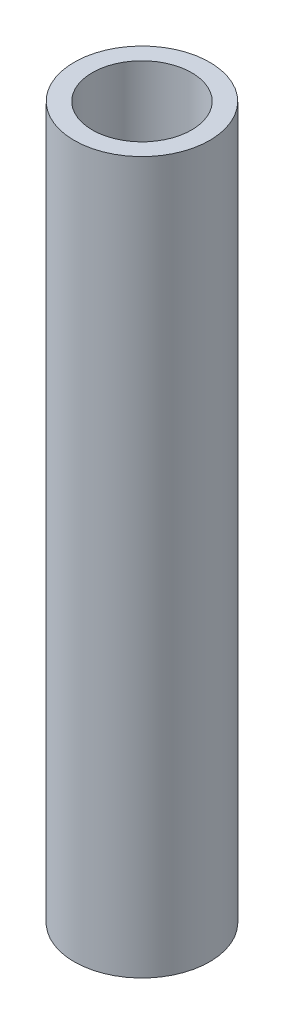
ISO-10303-21;
HEADER;
FILE_DESCRIPTION(('STEP AP214'),'2;1');
FILE_NAME('part.step','',(''),(''),'','','');
FILE_SCHEMA(('AUTOMOTIVE_DESIGN { 1 0 10303 214 1 1 1 1 }'));
ENDSEC;
DATA;
#1=APPLICATION_CONTEXT('core data for automotive mechanical design processes');
#2=APPLICATION_PROTOCOL_DEFINITION('international standard','automotive_design',2000,#1);
#3=PRODUCT_CONTEXT('',#1,'mechanical');
#4=PRODUCT('Part','Part','',(#3));
#5=PRODUCT_RELATED_PRODUCT_CATEGORY('part','',(#4));
#6=PRODUCT_DEFINITION_FORMATION('','',#4);
#7=PRODUCT_DEFINITION_CONTEXT('part definition',#1,'design');
#8=PRODUCT_DEFINITION('design','',#6,#7);
#9=PRODUCT_DEFINITION_SHAPE('','',#8);
#10=(LENGTH_UNIT() NAMED_UNIT(*) SI_UNIT(.MILLI.,.METRE.));
#11=(NAMED_UNIT(*) PLANE_ANGLE_UNIT() SI_UNIT($,.RADIAN.));
#12=(NAMED_UNIT(*) SI_UNIT($,.STERADIAN.) SOLID_ANGLE_UNIT());
#13=UNCERTAINTY_MEASURE_WITH_UNIT(LENGTH_MEASURE(1.E-05),#10,'distance_accuracy_value','');
#14=(GEOMETRIC_REPRESENTATION_CONTEXT(3) GLOBAL_UNCERTAINTY_ASSIGNED_CONTEXT((#13)) GLOBAL_UNIT_ASSIGNED_CONTEXT((#10,
#11,#12)) REPRESENTATION_CONTEXT('',''));
#15=CARTESIAN_POINT('',(0.,0.,0.));
#16=DIRECTION('',(0.,0.,1.));
#17=DIRECTION('',(1.,0.,0.));
#18=AXIS2_PLACEMENT_3D('',#15,#16,#17);
#19=CARTESIAN_POINT('',(0.,157.5,0.));
#20=DIRECTION('',(0.,1.,0.));
#21=DIRECTION('',(0.,0.,1.));
#22=AXIS2_PLACEMENT_3D('',#19,#20,#21);
#23=PLANE('',#22);
#24=CARTESIAN_POINT('',(0.,157.5,0.));
#25=DIRECTION('',(0.,1.,0.));
#26=DIRECTION('',(0.,0.,1.));
#27=AXIS2_PLACEMENT_3D('',#24,#25,#26);
#28=CIRCLE('',#27,15.);
#29=CARTESIAN_POINT('',(0.,157.5,15.));
#30=VERTEX_POINT('',#29);
#31=EDGE_CURVE('E10',#30,#30,#28,.T.);
#32=ORIENTED_EDGE('',*,*,#31,.T.);
#33=EDGE_LOOP('',(#32));
#34=FACE_BOUND('',#33,.T.);
#35=CARTESIAN_POINT('',(0.,157.5,0.));
#36=DIRECTION('',(0.,1.,0.));
#37=DIRECTION('',(0.,0.,1.));
#38=AXIS2_PLACEMENT_3D('',#35,#36,#37);
#39=CIRCLE('',#38,11.);
#40=CARTESIAN_POINT('',(0.,157.5,11.));
#41=VERTEX_POINT('',#40);
#42=EDGE_CURVE('E52',#41,#41,#39,.T.);
#43=ORIENTED_EDGE('',*,*,#42,.F.);
#44=EDGE_LOOP('',(#43));
#45=FACE_BOUND('',#44,.T.);
#46=ADVANCED_FACE('F41',(#34,#45),#23,.T.);
#47=CARTESIAN_POINT('',(0.,0.,0.));
#48=DIRECTION('',(0.,1.,0.));
#49=DIRECTION('',(0.,0.,1.));
#50=AXIS2_PLACEMENT_3D('',#47,#48,#49);
#51=PLANE('',#50);
#52=CARTESIAN_POINT('',(0.,0.,0.));
#53=DIRECTION('',(0.,1.,0.));
#54=DIRECTION('',(0.,0.,1.));
#55=AXIS2_PLACEMENT_3D('',#52,#53,#54);
#56=CIRCLE('',#55,15.);
#57=CARTESIAN_POINT('',(0.,0.,15.));
#58=VERTEX_POINT('',#57);
#59=EDGE_CURVE('E45',#58,#58,#56,.T.);
#60=ORIENTED_EDGE('',*,*,#59,.F.);
#61=EDGE_LOOP('',(#60));
#62=FACE_BOUND('',#61,.T.);
#63=CARTESIAN_POINT('',(0.,0.,0.));
#64=DIRECTION('',(0.,1.,0.));
#65=DIRECTION('',(0.,0.,1.));
#66=AXIS2_PLACEMENT_3D('',#63,#64,#65);
#67=CIRCLE('',#66,11.);
#68=CARTESIAN_POINT('',(0.,0.,11.));
#69=VERTEX_POINT('',#68);
#70=EDGE_CURVE('E54',#69,#69,#67,.T.);
#71=ORIENTED_EDGE('',*,*,#70,.T.);
#72=EDGE_LOOP('',(#71));
#73=FACE_BOUND('',#72,.T.);
#74=ADVANCED_FACE('F64',(#62,#73),#51,.F.);
#75=CARTESIAN_POINT('',(0.,157.5,0.));
#76=DIRECTION('',(0.,-1.,0.));
#77=DIRECTION('',(0.,0.,-1.));
#78=AXIS2_PLACEMENT_3D('',#75,#76,#77);
#79=CYLINDRICAL_SURFACE('',#78,15.);
#80=ORIENTED_EDGE('',*,*,#31,.F.);
#81=EDGE_LOOP('',(#80));
#82=FACE_BOUND('',#81,.T.);
#83=ORIENTED_EDGE('',*,*,#59,.T.);
#84=EDGE_LOOP('',(#83));
#85=FACE_BOUND('',#84,.T.);
#86=ADVANCED_FACE('F43',(#82,#85),#79,.T.);
#87=CARTESIAN_POINT('',(0.,157.5,0.));
#88=DIRECTION('',(0.,-1.,0.));
#89=DIRECTION('',(0.,0.,-1.));
#90=AXIS2_PLACEMENT_3D('',#87,#88,#89);
#91=CYLINDRICAL_SURFACE('',#90,11.);
#92=ORIENTED_EDGE('',*,*,#42,.T.);
#93=EDGE_LOOP('',(#92));
#94=FACE_BOUND('',#93,.T.);
#95=ORIENTED_EDGE('',*,*,#70,.F.);
#96=EDGE_LOOP('',(#95));
#97=FACE_BOUND('',#96,.T.);
#98=ADVANCED_FACE('F60',(#94,#97),#91,.F.);
#99=CLOSED_SHELL('',(#46,#74,#86,#98));
#100=MANIFOLD_SOLID_BREP('B2',#99);
#101=ADVANCED_BREP_SHAPE_REPRESENTATION('',(#18,#100),#14);
#102=SHAPE_DEFINITION_REPRESENTATION(#9,#101);
ENDSEC;
END-ISO-10303-21;
